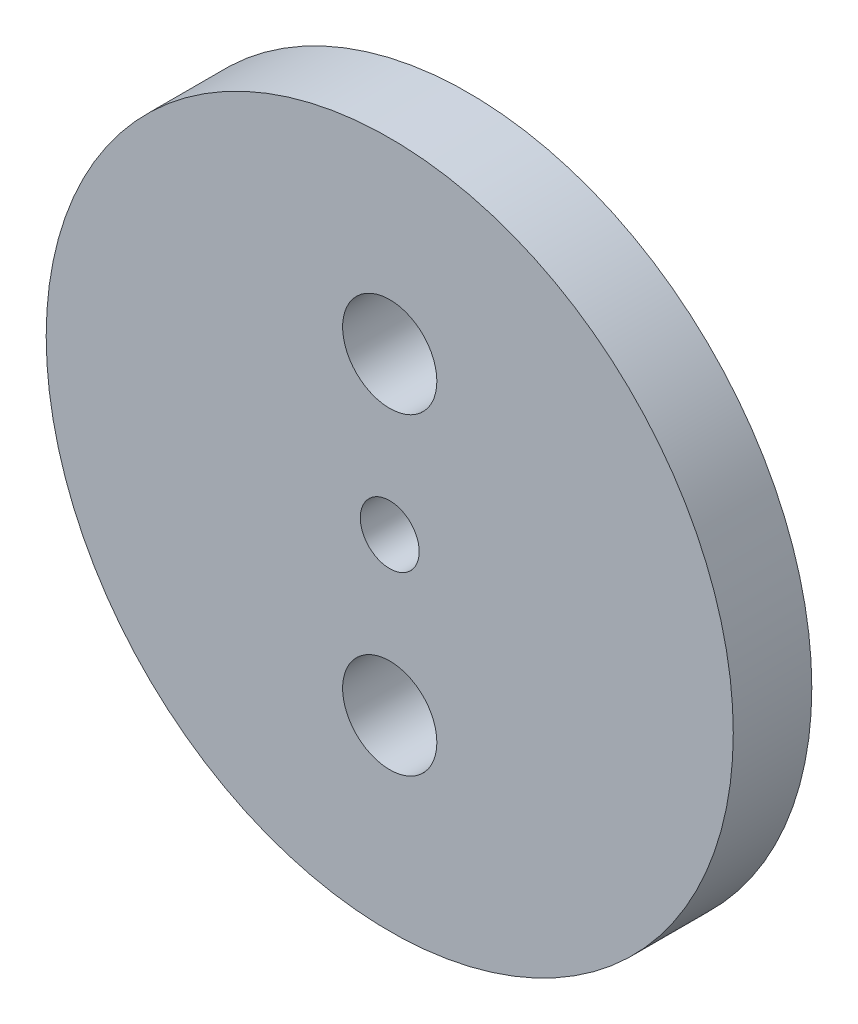
ISO-10303-21;
HEADER;
FILE_DESCRIPTION(('STEP AP214'),'2;1');
FILE_NAME('part.step','',(''),(''),'','','');
FILE_SCHEMA(('AUTOMOTIVE_DESIGN { 1 0 10303 214 1 1 1 1 }'));
ENDSEC;
DATA;
#1=APPLICATION_CONTEXT('core data for automotive mechanical design processes');
#2=APPLICATION_PROTOCOL_DEFINITION('international standard','automotive_design',2000,#1);
#3=PRODUCT_CONTEXT('',#1,'mechanical');
#4=PRODUCT('Part','Part','',(#3));
#5=PRODUCT_RELATED_PRODUCT_CATEGORY('part','',(#4));
#6=PRODUCT_DEFINITION_FORMATION('','',#4);
#7=PRODUCT_DEFINITION_CONTEXT('part definition',#1,'design');
#8=PRODUCT_DEFINITION('design','',#6,#7);
#9=PRODUCT_DEFINITION_SHAPE('','',#8);
#10=(LENGTH_UNIT() NAMED_UNIT(*) SI_UNIT(.MILLI.,.METRE.));
#11=(NAMED_UNIT(*) PLANE_ANGLE_UNIT() SI_UNIT($,.RADIAN.));
#12=(NAMED_UNIT(*) SI_UNIT($,.STERADIAN.) SOLID_ANGLE_UNIT());
#13=UNCERTAINTY_MEASURE_WITH_UNIT(LENGTH_MEASURE(1.E-05),#10,'distance_accuracy_value','');
#14=(GEOMETRIC_REPRESENTATION_CONTEXT(3) GLOBAL_UNCERTAINTY_ASSIGNED_CONTEXT((#13)) GLOBAL_UNIT_ASSIGNED_CONTEXT((#10,
#11,#12)) REPRESENTATION_CONTEXT('',''));
#15=CARTESIAN_POINT('',(0.,0.,0.));
#16=DIRECTION('',(0.,0.,1.));
#17=DIRECTION('',(1.,0.,0.));
#18=AXIS2_PLACEMENT_3D('',#15,#16,#17);
#19=CARTESIAN_POINT('',(0.,0.,4.));
#20=DIRECTION('',(0.,0.,1.));
#21=DIRECTION('',(1.,0.,0.));
#22=AXIS2_PLACEMENT_3D('',#19,#20,#21);
#23=PLANE('',#22);
#24=CARTESIAN_POINT('',(0.,-7.97,4.));
#25=DIRECTION('',(0.,0.,1.));
#26=DIRECTION('',(1.,0.,0.));
#27=AXIS2_PLACEMENT_3D('',#24,#25,#26);
#28=CIRCLE('',#27,2.4);
#29=CARTESIAN_POINT('',(2.4,-7.97,4.));
#30=VERTEX_POINT('',#29);
#31=EDGE_CURVE('E47',#30,#30,#28,.T.);
#32=ORIENTED_EDGE('',*,*,#31,.F.);
#33=EDGE_LOOP('',(#32));
#34=FACE_BOUND('',#33,.T.);
#35=CARTESIAN_POINT('',(0.,0.,4.));
#36=DIRECTION('',(0.,0.,1.));
#37=DIRECTION('',(1.,0.,0.));
#38=AXIS2_PLACEMENT_3D('',#35,#36,#37);
#39=CIRCLE('',#38,17.5);
#40=CARTESIAN_POINT('',(17.5,0.,4.));
#41=VERTEX_POINT('',#40);
#42=EDGE_CURVE('E10',#41,#41,#39,.T.);
#43=ORIENTED_EDGE('',*,*,#42,.T.);
#44=EDGE_LOOP('',(#43));
#45=FACE_BOUND('',#44,.T.);
#46=CARTESIAN_POINT('',(0.,7.97,4.));
#47=DIRECTION('',(0.,0.,1.));
#48=DIRECTION('',(1.,0.,0.));
#49=AXIS2_PLACEMENT_3D('',#46,#47,#48);
#50=CIRCLE('',#49,2.4);
#51=CARTESIAN_POINT('',(2.4,7.97,4.));
#52=VERTEX_POINT('',#51);
#53=EDGE_CURVE('E42',#52,#52,#50,.T.);
#54=ORIENTED_EDGE('',*,*,#53,.F.);
#55=EDGE_LOOP('',(#54));
#56=FACE_BOUND('',#55,.T.);
#57=CARTESIAN_POINT('',(0.,0.,4.));
#58=DIRECTION('',(0.,0.,1.));
#59=DIRECTION('',(1.,0.,0.));
#60=AXIS2_PLACEMENT_3D('',#57,#58,#59);
#61=CIRCLE('',#60,1.5);
#62=CARTESIAN_POINT('',(1.5,0.,4.));
#63=VERTEX_POINT('',#62);
#64=EDGE_CURVE('E53',#63,#63,#61,.T.);
#65=ORIENTED_EDGE('',*,*,#64,.F.);
#66=EDGE_LOOP('',(#65));
#67=FACE_BOUND('',#66,.T.);
#68=ADVANCED_FACE('F31',(#34,#45,#56,#67),#23,.T.);
#69=CARTESIAN_POINT('',(0.,0.,0.));
#70=DIRECTION('',(0.,0.,1.));
#71=DIRECTION('',(1.,0.,0.));
#72=AXIS2_PLACEMENT_3D('',#69,#70,#71);
#73=PLANE('',#72);
#74=CARTESIAN_POINT('',(0.,0.,0.));
#75=DIRECTION('',(0.,0.,1.));
#76=DIRECTION('',(1.,0.,0.));
#77=AXIS2_PLACEMENT_3D('',#74,#75,#76);
#78=CIRCLE('',#77,17.5);
#79=CARTESIAN_POINT('',(17.5,0.,0.));
#80=VERTEX_POINT('',#79);
#81=EDGE_CURVE('E35',#80,#80,#78,.T.);
#82=ORIENTED_EDGE('',*,*,#81,.F.);
#83=EDGE_LOOP('',(#82));
#84=FACE_BOUND('',#83,.T.);
#85=CARTESIAN_POINT('',(0.,7.97,0.));
#86=DIRECTION('',(0.,0.,1.));
#87=DIRECTION('',(1.,0.,0.));
#88=AXIS2_PLACEMENT_3D('',#85,#86,#87);
#89=CIRCLE('',#88,2.4);
#90=CARTESIAN_POINT('',(2.4,7.97,0.));
#91=VERTEX_POINT('',#90);
#92=EDGE_CURVE('E44',#91,#91,#89,.T.);
#93=ORIENTED_EDGE('',*,*,#92,.T.);
#94=EDGE_LOOP('',(#93));
#95=FACE_BOUND('',#94,.T.);
#96=CARTESIAN_POINT('',(0.,-7.97,0.));
#97=DIRECTION('',(0.,0.,1.));
#98=DIRECTION('',(1.,0.,0.));
#99=AXIS2_PLACEMENT_3D('',#96,#97,#98);
#100=CIRCLE('',#99,2.4);
#101=CARTESIAN_POINT('',(2.4,-7.97,0.));
#102=VERTEX_POINT('',#101);
#103=EDGE_CURVE('E50',#102,#102,#100,.T.);
#104=ORIENTED_EDGE('',*,*,#103,.T.);
#105=EDGE_LOOP('',(#104));
#106=FACE_BOUND('',#105,.T.);
#107=CARTESIAN_POINT('',(0.,0.,0.));
#108=DIRECTION('',(0.,0.,1.));
#109=DIRECTION('',(1.,0.,0.));
#110=AXIS2_PLACEMENT_3D('',#107,#108,#109);
#111=CIRCLE('',#110,1.5);
#112=CARTESIAN_POINT('',(1.5,0.,0.));
#113=VERTEX_POINT('',#112);
#114=EDGE_CURVE('E56',#113,#113,#111,.T.);
#115=ORIENTED_EDGE('',*,*,#114,.T.);
#116=EDGE_LOOP('',(#115));
#117=FACE_BOUND('',#116,.T.);
#118=ADVANCED_FACE('F66',(#84,#95,#106,#117),#73,.F.);
#119=CARTESIAN_POINT('',(0.,0.,4.));
#120=DIRECTION('',(0.,0.,-1.));
#121=DIRECTION('',(-1.,0.,0.));
#122=AXIS2_PLACEMENT_3D('',#119,#120,#121);
#123=CYLINDRICAL_SURFACE('',#122,17.5);
#124=ORIENTED_EDGE('',*,*,#42,.F.);
#125=EDGE_LOOP('',(#124));
#126=FACE_BOUND('',#125,.T.);
#127=ORIENTED_EDGE('',*,*,#81,.T.);
#128=EDGE_LOOP('',(#127));
#129=FACE_BOUND('',#128,.T.);
#130=ADVANCED_FACE('F33',(#126,#129),#123,.T.);
#131=CARTESIAN_POINT('',(0.,7.97,4.));
#132=DIRECTION('',(0.,0.,-1.));
#133=DIRECTION('',(-1.,0.,0.));
#134=AXIS2_PLACEMENT_3D('',#131,#132,#133);
#135=CYLINDRICAL_SURFACE('',#134,2.4);
#136=ORIENTED_EDGE('',*,*,#53,.T.);
#137=EDGE_LOOP('',(#136));
#138=FACE_BOUND('',#137,.T.);
#139=ORIENTED_EDGE('',*,*,#92,.F.);
#140=EDGE_LOOP('',(#139));
#141=FACE_BOUND('',#140,.T.);
#142=ADVANCED_FACE('F75',(#138,#141),#135,.F.);
#143=CARTESIAN_POINT('',(0.,-7.97,4.));
#144=DIRECTION('',(0.,0.,-1.));
#145=DIRECTION('',(-1.,0.,0.));
#146=AXIS2_PLACEMENT_3D('',#143,#144,#145);
#147=CYLINDRICAL_SURFACE('',#146,2.4);
#148=ORIENTED_EDGE('',*,*,#31,.T.);
#149=EDGE_LOOP('',(#148));
#150=FACE_BOUND('',#149,.T.);
#151=ORIENTED_EDGE('',*,*,#103,.F.);
#152=EDGE_LOOP('',(#151));
#153=FACE_BOUND('',#152,.T.);
#154=ADVANCED_FACE('F78',(#150,#153),#147,.F.);
#155=CARTESIAN_POINT('',(0.,0.,4.));
#156=DIRECTION('',(0.,0.,-1.));
#157=DIRECTION('',(-1.,0.,0.));
#158=AXIS2_PLACEMENT_3D('',#155,#156,#157);
#159=CYLINDRICAL_SURFACE('',#158,1.5);
#160=ORIENTED_EDGE('',*,*,#64,.T.);
#161=EDGE_LOOP('',(#160));
#162=FACE_BOUND('',#161,.T.);
#163=ORIENTED_EDGE('',*,*,#114,.F.);
#164=EDGE_LOOP('',(#163));
#165=FACE_BOUND('',#164,.T.);
#166=ADVANCED_FACE('F62',(#162,#165),#159,.F.);
#167=CLOSED_SHELL('',(#68,#118,#130,#142,#154,#166));
#168=MANIFOLD_SOLID_BREP('B2',#167);
#169=ADVANCED_BREP_SHAPE_REPRESENTATION('',(#18,#168),#14);
#170=SHAPE_DEFINITION_REPRESENTATION(#9,#169);
ENDSEC;
END-ISO-10303-21;
